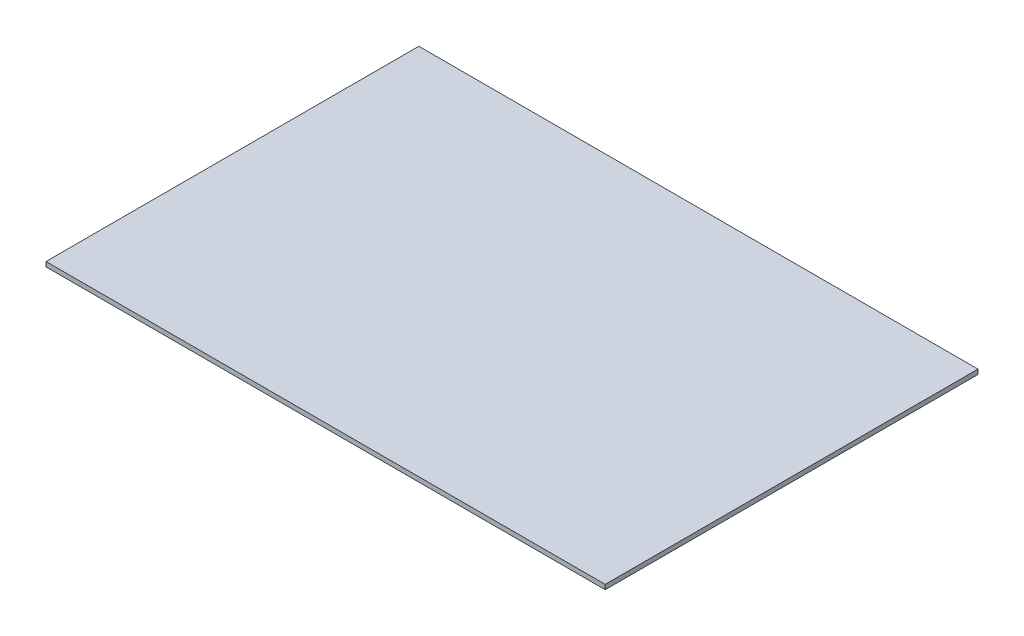
ISO-10303-21;
HEADER;
FILE_DESCRIPTION(('STEP AP214'),'2;1');
FILE_NAME('part.step','',(''),(''),'','','');
FILE_SCHEMA(('AUTOMOTIVE_DESIGN { 1 0 10303 214 1 1 1 1 }'));
ENDSEC;
DATA;
#1=APPLICATION_CONTEXT('core data for automotive mechanical design processes');
#2=APPLICATION_PROTOCOL_DEFINITION('international standard','automotive_design',2000,#1);
#3=PRODUCT_CONTEXT('',#1,'mechanical');
#4=PRODUCT('Part','Part','',(#3));
#5=PRODUCT_RELATED_PRODUCT_CATEGORY('part','',(#4));
#6=PRODUCT_DEFINITION_FORMATION('','',#4);
#7=PRODUCT_DEFINITION_CONTEXT('part definition',#1,'design');
#8=PRODUCT_DEFINITION('design','',#6,#7);
#9=PRODUCT_DEFINITION_SHAPE('','',#8);
#10=(LENGTH_UNIT() NAMED_UNIT(*) SI_UNIT(.MILLI.,.METRE.));
#11=(NAMED_UNIT(*) PLANE_ANGLE_UNIT() SI_UNIT($,.RADIAN.));
#12=(NAMED_UNIT(*) SI_UNIT($,.STERADIAN.) SOLID_ANGLE_UNIT());
#13=UNCERTAINTY_MEASURE_WITH_UNIT(LENGTH_MEASURE(1.E-05),#10,'distance_accuracy_value','');
#14=(GEOMETRIC_REPRESENTATION_CONTEXT(3) GLOBAL_UNCERTAINTY_ASSIGNED_CONTEXT((#13)) GLOBAL_UNIT_ASSIGNED_CONTEXT((#10,
#11,#12)) REPRESENTATION_CONTEXT('',''));
#15=CARTESIAN_POINT('',(0.,0.,0.));
#16=DIRECTION('',(0.,0.,1.));
#17=DIRECTION('',(1.,0.,0.));
#18=AXIS2_PLACEMENT_3D('',#15,#16,#17);
#19=CARTESIAN_POINT('',(0.,100.,0.));
#20=DIRECTION('',(1.,0.,0.));
#21=DIRECTION('',(0.,0.,-1.));
#22=AXIS2_PLACEMENT_3D('',#19,#20,#21);
#23=PLANE('',#22);
#24=DIRECTION('',(0.,0.,1.));
#25=VECTOR('',#24,1.);
#26=CARTESIAN_POINT('',(0.,0.,0.));
#27=LINE('',#26,#25);
#28=CARTESIAN_POINT('',(0.,0.,-8000.));
#29=VERTEX_POINT('',#28);
#30=CARTESIAN_POINT('',(0.,0.,0.));
#31=VERTEX_POINT('',#30);
#32=EDGE_CURVE('E100',#29,#31,#27,.T.);
#33=ORIENTED_EDGE('',*,*,#32,.T.);
#34=DIRECTION('',(0.,-1.,0.));
#35=VECTOR('',#34,1.);
#36=CARTESIAN_POINT('',(0.,100.,0.));
#37=LINE('',#36,#35);
#38=CARTESIAN_POINT('',(0.,100.,0.));
#39=VERTEX_POINT('',#38);
#40=EDGE_CURVE('E11',#39,#31,#37,.T.);
#41=ORIENTED_EDGE('',*,*,#40,.F.);
#42=DIRECTION('',(0.,0.,1.));
#43=VECTOR('',#42,1.);
#44=CARTESIAN_POINT('',(0.,100.,0.));
#45=LINE('',#44,#43);
#46=CARTESIAN_POINT('',(0.,100.,-8000.));
#47=VERTEX_POINT('',#46);
#48=EDGE_CURVE('E88',#47,#39,#45,.T.);
#49=ORIENTED_EDGE('',*,*,#48,.F.);
#50=DIRECTION('',(0.,-1.,0.));
#51=VECTOR('',#50,1.);
#52=CARTESIAN_POINT('',(0.,100.,-8000.));
#53=LINE('',#52,#51);
#54=EDGE_CURVE('E96',#47,#29,#53,.T.);
#55=ORIENTED_EDGE('',*,*,#54,.T.);
#56=EDGE_LOOP('',(#33,#41,#49,#55));
#57=FACE_BOUND('',#56,.T.);
#58=ADVANCED_FACE('F37',(#57),#23,.F.);
#59=CARTESIAN_POINT('',(0.,100.,0.));
#60=DIRECTION('',(0.,0.,-1.));
#61=DIRECTION('',(-1.,0.,0.));
#62=AXIS2_PLACEMENT_3D('',#59,#60,#61);
#63=PLANE('',#62);
#64=DIRECTION('',(1.,0.,0.));
#65=VECTOR('',#64,1.);
#66=CARTESIAN_POINT('',(0.,0.,0.));
#67=LINE('',#66,#65);
#68=CARTESIAN_POINT('',(12000.,0.,0.));
#69=VERTEX_POINT('',#68);
#70=EDGE_CURVE('E92',#31,#69,#67,.T.);
#71=ORIENTED_EDGE('',*,*,#70,.T.);
#72=DIRECTION('',(0.,-1.,0.));
#73=VECTOR('',#72,1.);
#74=CARTESIAN_POINT('',(12000.,100.,0.));
#75=LINE('',#74,#73);
#76=CARTESIAN_POINT('',(12000.,100.,0.));
#77=VERTEX_POINT('',#76);
#78=EDGE_CURVE('E45',#77,#69,#75,.T.);
#79=ORIENTED_EDGE('',*,*,#78,.F.);
#80=DIRECTION('',(1.,0.,0.));
#81=VECTOR('',#80,1.);
#82=CARTESIAN_POINT('',(0.,100.,0.));
#83=LINE('',#82,#81);
#84=EDGE_CURVE('E83',#39,#77,#83,.T.);
#85=ORIENTED_EDGE('',*,*,#84,.F.);
#86=ORIENTED_EDGE('',*,*,#40,.T.);
#87=EDGE_LOOP('',(#71,#79,#85,#86));
#88=FACE_BOUND('',#87,.T.);
#89=ADVANCED_FACE('F91',(#88),#63,.F.);
#90=CARTESIAN_POINT('',(12000.,100.,0.));
#91=DIRECTION('',(-1.,0.,0.));
#92=DIRECTION('',(0.,0.,1.));
#93=AXIS2_PLACEMENT_3D('',#90,#91,#92);
#94=PLANE('',#93);
#95=DIRECTION('',(0.,0.,-1.));
#96=VECTOR('',#95,1.);
#97=CARTESIAN_POINT('',(12000.,0.,0.));
#98=LINE('',#97,#96);
#99=CARTESIAN_POINT('',(12000.,0.,-8000.));
#100=VERTEX_POINT('',#99);
#101=EDGE_CURVE('E70',#69,#100,#98,.T.);
#102=ORIENTED_EDGE('',*,*,#101,.T.);
#103=DIRECTION('',(0.,-1.,0.));
#104=VECTOR('',#103,1.);
#105=CARTESIAN_POINT('',(12000.,100.,-8000.));
#106=LINE('',#105,#104);
#107=CARTESIAN_POINT('',(12000.,100.,-8000.));
#108=VERTEX_POINT('',#107);
#109=EDGE_CURVE('E93',#108,#100,#106,.T.);
#110=ORIENTED_EDGE('',*,*,#109,.F.);
#111=DIRECTION('',(0.,0.,-1.));
#112=VECTOR('',#111,1.);
#113=CARTESIAN_POINT('',(12000.,100.,0.));
#114=LINE('',#113,#112);
#115=EDGE_CURVE('E86',#77,#108,#114,.T.);
#116=ORIENTED_EDGE('',*,*,#115,.F.);
#117=ORIENTED_EDGE('',*,*,#78,.T.);
#118=EDGE_LOOP('',(#102,#110,#116,#117));
#119=FACE_BOUND('',#118,.T.);
#120=ADVANCED_FACE('F94',(#119),#94,.F.);
#121=CARTESIAN_POINT('',(0.,100.,-8000.));
#122=DIRECTION('',(0.,0.,1.));
#123=DIRECTION('',(1.,0.,0.));
#124=AXIS2_PLACEMENT_3D('',#121,#122,#123);
#125=PLANE('',#124);
#126=DIRECTION('',(-1.,0.,0.));
#127=VECTOR('',#126,1.);
#128=CARTESIAN_POINT('',(0.,0.,-8000.));
#129=LINE('',#128,#127);
#130=EDGE_CURVE('E76',#100,#29,#129,.T.);
#131=ORIENTED_EDGE('',*,*,#130,.T.);
#132=ORIENTED_EDGE('',*,*,#54,.F.);
#133=DIRECTION('',(-1.,0.,0.));
#134=VECTOR('',#133,1.);
#135=CARTESIAN_POINT('',(0.,100.,-8000.));
#136=LINE('',#135,#134);
#137=EDGE_CURVE('E53',#108,#47,#136,.T.);
#138=ORIENTED_EDGE('',*,*,#137,.F.);
#139=ORIENTED_EDGE('',*,*,#109,.T.);
#140=EDGE_LOOP('',(#131,#132,#138,#139));
#141=FACE_BOUND('',#140,.T.);
#142=ADVANCED_FACE('F107',(#141),#125,.F.);
#143=CARTESIAN_POINT('',(0.,100.,0.));
#144=DIRECTION('',(0.,-1.,0.));
#145=DIRECTION('',(0.,0.,-1.));
#146=AXIS2_PLACEMENT_3D('',#143,#144,#145);
#147=PLANE('',#146);
#148=ORIENTED_EDGE('',*,*,#48,.T.);
#149=ORIENTED_EDGE('',*,*,#84,.T.);
#150=ORIENTED_EDGE('',*,*,#115,.T.);
#151=ORIENTED_EDGE('',*,*,#137,.T.);
#152=EDGE_LOOP('',(#148,#149,#150,#151));
#153=FACE_BOUND('',#152,.T.);
#154=ADVANCED_FACE('F84',(#153),#147,.F.);
#155=CARTESIAN_POINT('',(0.,0.,0.));
#156=DIRECTION('',(0.,-1.,0.));
#157=DIRECTION('',(0.,0.,-1.));
#158=AXIS2_PLACEMENT_3D('',#155,#156,#157);
#159=PLANE('',#158);
#160=ORIENTED_EDGE('',*,*,#32,.F.);
#161=ORIENTED_EDGE('',*,*,#130,.F.);
#162=ORIENTED_EDGE('',*,*,#101,.F.);
#163=ORIENTED_EDGE('',*,*,#70,.F.);
#164=EDGE_LOOP('',(#160,#161,#162,#163));
#165=FACE_BOUND('',#164,.T.);
#166=ADVANCED_FACE('F110',(#165),#159,.T.);
#167=CLOSED_SHELL('',(#58,#89,#120,#142,#154,#166));
#168=MANIFOLD_SOLID_BREP('B2',#167);
#169=ADVANCED_BREP_SHAPE_REPRESENTATION('',(#18,#168),#14);
#170=SHAPE_DEFINITION_REPRESENTATION(#9,#169);
ENDSEC;
END-ISO-10303-21;
